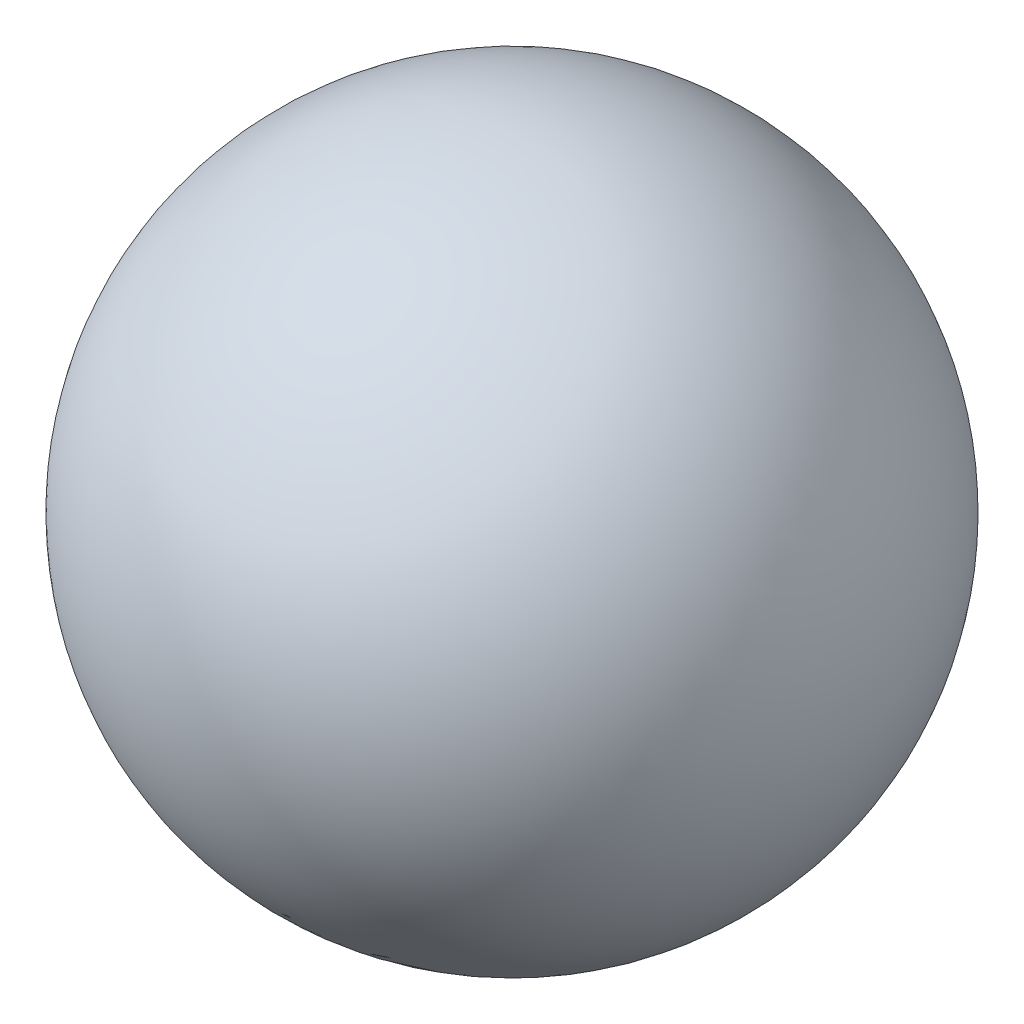
ISO-10303-21;
HEADER;
FILE_DESCRIPTION(('STEP AP214'),'2;1');
FILE_NAME('part.step','',(''),(''),'','','');
FILE_SCHEMA(('AUTOMOTIVE_DESIGN { 1 0 10303 214 1 1 1 1 }'));
ENDSEC;
DATA;
#1=APPLICATION_CONTEXT('core data for automotive mechanical design processes');
#2=APPLICATION_PROTOCOL_DEFINITION('international standard','automotive_design',2000,#1);
#3=PRODUCT_CONTEXT('',#1,'mechanical');
#4=PRODUCT('Part','Part','',(#3));
#5=PRODUCT_RELATED_PRODUCT_CATEGORY('part','',(#4));
#6=PRODUCT_DEFINITION_FORMATION('','',#4);
#7=PRODUCT_DEFINITION_CONTEXT('part definition',#1,'design');
#8=PRODUCT_DEFINITION('design','',#6,#7);
#9=PRODUCT_DEFINITION_SHAPE('','',#8);
#10=(LENGTH_UNIT() NAMED_UNIT(*) SI_UNIT(.MILLI.,.METRE.));
#11=(NAMED_UNIT(*) PLANE_ANGLE_UNIT() SI_UNIT($,.RADIAN.));
#12=(NAMED_UNIT(*) SI_UNIT($,.STERADIAN.) SOLID_ANGLE_UNIT());
#13=UNCERTAINTY_MEASURE_WITH_UNIT(LENGTH_MEASURE(1.E-05),#10,'distance_accuracy_value','');
#14=(GEOMETRIC_REPRESENTATION_CONTEXT(3) GLOBAL_UNCERTAINTY_ASSIGNED_CONTEXT((#13)) GLOBAL_UNIT_ASSIGNED_CONTEXT((#10,
#11,#12)) REPRESENTATION_CONTEXT('',''));
#15=CARTESIAN_POINT('',(0.,0.,0.));
#16=DIRECTION('',(0.,0.,1.));
#17=DIRECTION('',(1.,0.,0.));
#18=AXIS2_PLACEMENT_3D('',#15,#16,#17);
#19=CARTESIAN_POINT('',(64.16,27.0858634108856,63.8776697468439));
#20=DIRECTION('',(0.,0.390381842971414,0.920653038162718));
#21=DIRECTION('',(0.173648177666934,-0.906666249816888,0.384451065593442));
#22=AXIS2_PLACEMENT_3D('',#19,#20,#21);
#23=SPHERICAL_SURFACE('',#22,7.15);
#24=CARTESIAN_POINT('',(64.16,29.8770935881312,70.4603389697073));
#25=VERTEX_POINT('',#24);
#26=VERTEX_LOOP('',#25);
#27=FACE_BOUND('',#26,.T.);
#28=CARTESIAN_POINT('',(64.16,24.29463323364,57.2950005239805));
#29=VERTEX_POINT('',#28);
#30=VERTEX_LOOP('',#29);
#31=FACE_BOUND('',#30,.T.);
#32=ADVANCED_FACE('F15',(#27,#31),#23,.T.);
#33=CLOSED_SHELL('',(#32));
#34=MANIFOLD_SOLID_BREP('B1',#33);
#35=ADVANCED_BREP_SHAPE_REPRESENTATION('',(#18,#34),#14);
#36=SHAPE_DEFINITION_REPRESENTATION(#9,#35);
ENDSEC;
END-ISO-10303-21;
